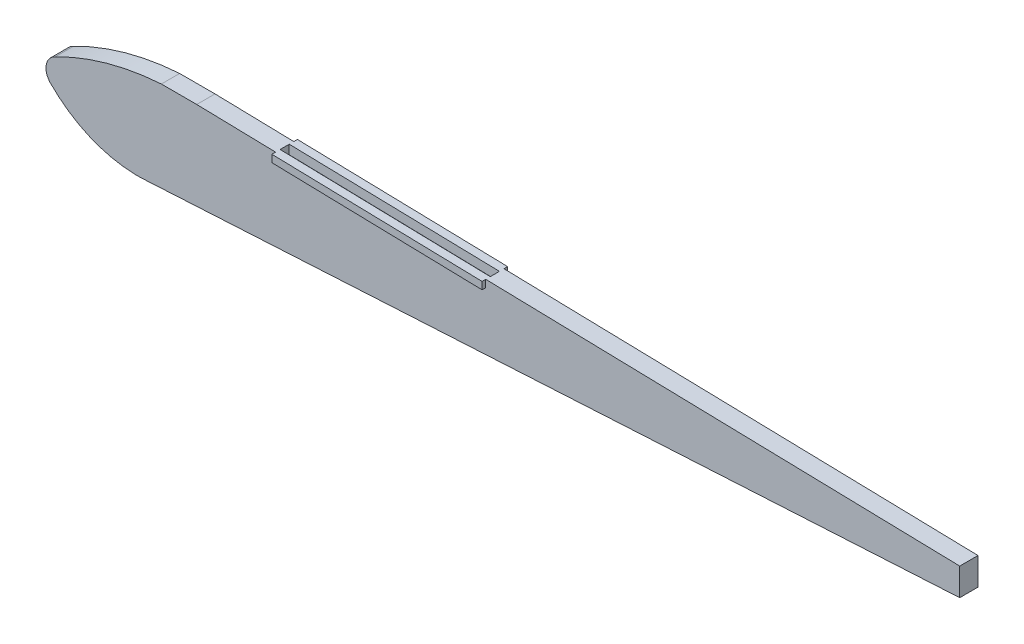
ISO-10303-21;
HEADER;
FILE_DESCRIPTION(('STEP AP214'),'2;1');
FILE_NAME('part.step','',(''),(''),'','','');
FILE_SCHEMA(('AUTOMOTIVE_DESIGN { 1 0 10303 214 1 1 1 1 }'));
ENDSEC;
DATA;
#1=APPLICATION_CONTEXT('core data for automotive mechanical design processes');
#2=APPLICATION_PROTOCOL_DEFINITION('international standard','automotive_design',2000,#1);
#3=PRODUCT_CONTEXT('',#1,'mechanical');
#4=PRODUCT('Part','Part','',(#3));
#5=PRODUCT_RELATED_PRODUCT_CATEGORY('part','',(#4));
#6=PRODUCT_DEFINITION_FORMATION('','',#4);
#7=PRODUCT_DEFINITION_CONTEXT('part definition',#1,'design');
#8=PRODUCT_DEFINITION('design','',#6,#7);
#9=PRODUCT_DEFINITION_SHAPE('','',#8);
#10=(LENGTH_UNIT() NAMED_UNIT(*) SI_UNIT(.MILLI.,.METRE.));
#11=(NAMED_UNIT(*) PLANE_ANGLE_UNIT() SI_UNIT($,.RADIAN.));
#12=(NAMED_UNIT(*) SI_UNIT($,.STERADIAN.) SOLID_ANGLE_UNIT());
#13=UNCERTAINTY_MEASURE_WITH_UNIT(LENGTH_MEASURE(1.E-05),#10,'distance_accuracy_value','');
#14=(GEOMETRIC_REPRESENTATION_CONTEXT(3) GLOBAL_UNCERTAINTY_ASSIGNED_CONTEXT((#13)) GLOBAL_UNIT_ASSIGNED_CONTEXT((#10,
#11,#12)) REPRESENTATION_CONTEXT('',''));
#15=CARTESIAN_POINT('',(0.,0.,0.));
#16=DIRECTION('',(0.,0.,1.));
#17=DIRECTION('',(1.,0.,0.));
#18=AXIS2_PLACEMENT_3D('',#15,#16,#17);
#19=CARTESIAN_POINT('',(533.352405612948,25.,10.));
#20=DIRECTION('',(-1.,0.,0.));
#21=DIRECTION('',(0.,0.,1.));
#22=AXIS2_PLACEMENT_3D('',#19,#20,#21);
#23=PLANE('',#22);
#24=DIRECTION('',(0.,0.,1.));
#25=VECTOR('',#24,1.);
#26=CARTESIAN_POINT('',(533.352405612948,15.,0.));
#27=LINE('',#26,#25);
#28=CARTESIAN_POINT('',(533.352405612948,15.,0.));
#29=VERTEX_POINT('',#28);
#30=CARTESIAN_POINT('',(533.352405612948,15.,10.));
#31=VERTEX_POINT('',#30);
#32=EDGE_CURVE('E307',#29,#31,#27,.T.);
#33=ORIENTED_EDGE('',*,*,#32,.T.);
#34=DIRECTION('',(0.,1.,0.));
#35=VECTOR('',#34,1.);
#36=CARTESIAN_POINT('',(533.352405612948,25.,10.));
#37=LINE('',#36,#35);
#38=CARTESIAN_POINT('',(533.352405612948,0.,10.));
#39=VERTEX_POINT('',#38);
#40=EDGE_CURVE('E340',#39,#31,#37,.T.);
#41=ORIENTED_EDGE('',*,*,#40,.F.);
#42=DIRECTION('',(0.,0.,1.));
#43=VECTOR('',#42,1.);
#44=CARTESIAN_POINT('',(533.352405612948,0.,0.));
#45=LINE('',#44,#43);
#46=CARTESIAN_POINT('',(533.352405612948,0.,0.));
#47=VERTEX_POINT('',#46);
#48=EDGE_CURVE('E299',#47,#39,#45,.T.);
#49=ORIENTED_EDGE('',*,*,#48,.F.);
#50=DIRECTION('',(0.,1.,0.));
#51=VECTOR('',#50,1.);
#52=CARTESIAN_POINT('',(533.352405612948,25.,0.));
#53=LINE('',#52,#51);
#54=EDGE_CURVE('E333',#47,#29,#53,.T.);
#55=ORIENTED_EDGE('',*,*,#54,.T.);
#56=EDGE_LOOP('',(#33,#41,#49,#55));
#57=FACE_BOUND('',#56,.T.);
#58=ADVANCED_FACE('F64',(#57),#23,.F.);
#59=CARTESIAN_POINT('',(33.3524056129477,25.,10.));
#60=DIRECTION('',(0.,-1.,0.));
#61=DIRECTION('',(0.,0.,-1.));
#62=AXIS2_PLACEMENT_3D('',#59,#60,#61);
#63=PLANE('',#62);
#64=DIRECTION('',(0.,0.,1.));
#65=VECTOR('',#64,1.);
#66=CARTESIAN_POINT('',(115.905115223947,25.,0.));
#67=LINE('',#66,#65);
#68=CARTESIAN_POINT('',(115.905115223947,25.,0.));
#69=VERTEX_POINT('',#68);
#70=CARTESIAN_POINT('',(115.905115223947,25.,10.));
#71=VERTEX_POINT('',#70);
#72=EDGE_CURVE('E298',#69,#71,#67,.T.);
#73=ORIENTED_EDGE('',*,*,#72,.F.);
#74=DIRECTION('',(-1.,0.,0.));
#75=VECTOR('',#74,1.);
#76=CARTESIAN_POINT('',(33.3524056129477,25.,0.));
#77=LINE('',#76,#75);
#78=CARTESIAN_POINT('',(96.5365990158575,25.,0.));
#79=VERTEX_POINT('',#78);
#80=EDGE_CURVE('E351',#69,#79,#77,.T.);
#81=ORIENTED_EDGE('',*,*,#80,.T.);
#82=DIRECTION('',(0.,0.,1.));
#83=VECTOR('',#82,1.);
#84=CARTESIAN_POINT('',(96.5365990158575,25.,0.));
#85=LINE('',#84,#83);
#86=CARTESIAN_POINT('',(96.5365990158575,25.,10.));
#87=VERTEX_POINT('',#86);
#88=EDGE_CURVE('E336',#79,#87,#85,.T.);
#89=ORIENTED_EDGE('',*,*,#88,.T.);
#90=DIRECTION('',(-1.,0.,0.));
#91=VECTOR('',#90,1.);
#92=CARTESIAN_POINT('',(33.3524056129477,25.,10.));
#93=LINE('',#92,#91);
#94=EDGE_CURVE('E343',#71,#87,#93,.T.);
#95=ORIENTED_EDGE('',*,*,#94,.F.);
#96=EDGE_LOOP('',(#73,#81,#89,#95));
#97=FACE_BOUND('',#96,.T.);
#98=ADVANCED_FACE('F385',(#97),#63,.F.);
#99=CARTESIAN_POINT('',(33.3524056129477,-25.,10.));
#100=DIRECTION('',(0.,1.,0.));
#101=DIRECTION('',(-1.,0.,0.));
#102=AXIS2_PLACEMENT_3D('',#99,#100,#101);
#103=PLANE('',#102);
#104=DIRECTION('',(0.,0.,1.));
#105=VECTOR('',#104,1.);
#106=CARTESIAN_POINT('',(85.6277654450882,-25.,0.));
#107=LINE('',#106,#105);
#108=CARTESIAN_POINT('',(85.6277654450882,-25.,0.));
#109=VERTEX_POINT('',#108);
#110=CARTESIAN_POINT('',(85.6277654450882,-25.,10.));
#111=VERTEX_POINT('',#110);
#112=EDGE_CURVE('E294',#109,#111,#107,.T.);
#113=ORIENTED_EDGE('',*,*,#112,.T.);
#114=DIRECTION('',(1.,0.,0.));
#115=VECTOR('',#114,1.);
#116=CARTESIAN_POINT('',(33.3524056129477,-25.,10.));
#117=LINE('',#116,#115);
#118=CARTESIAN_POINT('',(81.9930406640099,-25.,10.));
#119=VERTEX_POINT('',#118);
#120=EDGE_CURVE('E71',#119,#111,#117,.T.);
#121=ORIENTED_EDGE('',*,*,#120,.F.);
#122=DIRECTION('',(0.,0.,1.));
#123=VECTOR('',#122,1.);
#124=CARTESIAN_POINT('',(81.9930406640099,-25.,0.));
#125=LINE('',#124,#123);
#126=CARTESIAN_POINT('',(81.9930406640099,-25.,0.));
#127=VERTEX_POINT('',#126);
#128=EDGE_CURVE('E334',#127,#119,#125,.T.);
#129=ORIENTED_EDGE('',*,*,#128,.F.);
#130=DIRECTION('',(1.,0.,0.));
#131=VECTOR('',#130,1.);
#132=CARTESIAN_POINT('',(33.3524056129477,-25.,0.));
#133=LINE('',#132,#131);
#134=EDGE_CURVE('E344',#127,#109,#133,.T.);
#135=ORIENTED_EDGE('',*,*,#134,.T.);
#136=EDGE_LOOP('',(#113,#121,#129,#135));
#137=FACE_BOUND('',#136,.T.);
#138=ADVANCED_FACE('F357',(#137),#103,.F.);
#139=CARTESIAN_POINT('',(0.,0.,10.));
#140=DIRECTION('',(0.,0.,1.));
#141=DIRECTION('',(1.,0.,0.));
#142=AXIS2_PLACEMENT_3D('',#139,#140,#141);
#143=PLANE('',#142);
#144=DIRECTION('',(0.,-1.,0.));
#145=VECTOR('',#144,1.);
#146=CARTESIAN_POINT('',(159.003178699736,0.,10.));
#147=LINE('',#146,#145);
#148=CARTESIAN_POINT('',(159.003178699736,23.9675807109533,10.));
#149=VERTEX_POINT('',#148);
#150=CARTESIAN_POINT('',(159.003178699736,19.9675807109533,10.));
#151=VERTEX_POINT('',#150);
#152=EDGE_CURVE('E288',#149,#151,#147,.T.);
#153=ORIENTED_EDGE('',*,*,#152,.F.);
#154=DIRECTION('',(-0.999713199538115,0.0239482498163188,0.));
#155=VECTOR('',#154,1.);
#156=CARTESIAN_POINT('',(0.665008283624476,27.7605906085277,10.));
#157=LINE('',#156,#155);
#158=EDGE_CURVE('E291',#149,#71,#157,.T.);
#159=ORIENTED_EDGE('',*,*,#158,.T.);
#160=ORIENTED_EDGE('',*,*,#94,.T.);
#161=CARTESIAN_POINT('',(106.220857119902,-122.230401184775,10.));
#162=DIRECTION('',(0.,0.,1.));
#163=DIRECTION('',(1.,0.,0.));
#164=AXIS2_PLACEMENT_3D('',#161,#162,#163);
#165=CIRCLE('',#164,147.548554340785);
#166=CARTESIAN_POINT('',(38.404725067647,8.80985263643309,10.));
#167=VERTEX_POINT('',#166);
#168=EDGE_CURVE('E326',#167,#87,#165,.F.);
#169=ORIENTED_EDGE('',*,*,#168,.F.);
#170=CARTESIAN_POINT('',(41.9407111893882,1.05133472372193,10.));
#171=DIRECTION('',(0.,0.,1.));
#172=DIRECTION('',(1.,0.,0.));
#173=AXIS2_PLACEMENT_3D('',#170,#171,#172);
#174=CIRCLE('',#173,8.52630037325727);
#175=CARTESIAN_POINT('',(35.7524239757133,-4.81406376368488,10.));
#176=VERTEX_POINT('',#175);
#177=EDGE_CURVE('E301',#167,#176,#174,.T.);
#178=ORIENTED_EDGE('',*,*,#177,.T.);
#179=CARTESIAN_POINT('',(83.8104030545491,42.2185460473653,10.));
#180=DIRECTION('',(0.,0.,1.));
#181=DIRECTION('',(1.,0.,0.));
#182=AXIS2_PLACEMENT_3D('',#179,#180,#181);
#183=CIRCLE('',#182,67.2431092289784);
#184=EDGE_CURVE('E318',#176,#119,#183,.T.);
#185=ORIENTED_EDGE('',*,*,#184,.T.);
#186=ORIENTED_EDGE('',*,*,#120,.T.);
#187=DIRECTION('',(0.998444700893418,0.0557510471458017,0.));
#188=VECTOR('',#187,1.);
#189=CARTESIAN_POINT('',(1.65775488425238,-29.6887083615363,10.));
#190=LINE('',#189,#188);
#191=EDGE_CURVE('E295',#111,#39,#190,.T.);
#192=ORIENTED_EDGE('',*,*,#191,.T.);
#193=ORIENTED_EDGE('',*,*,#40,.T.);
#194=CARTESIAN_POINT('',(274.003178699737,21.2127418930312,10.));
#195=VERTEX_POINT('',#194);
#196=EDGE_CURVE('E309',#31,#195,#157,.T.);
#197=ORIENTED_EDGE('',*,*,#196,.T.);
#198=DIRECTION('',(0.,1.,0.));
#199=VECTOR('',#198,1.);
#200=CARTESIAN_POINT('',(274.003178699736,0.,10.));
#201=LINE('',#200,#199);
#202=CARTESIAN_POINT('',(274.003178699736,17.2127418930312,10.));
#203=VERTEX_POINT('',#202);
#204=EDGE_CURVE('E282',#203,#195,#201,.T.);
#205=ORIENTED_EDGE('',*,*,#204,.F.);
#206=DIRECTION('',(0.999713199538115,-0.023948249816319,0.));
#207=VECTOR('',#206,1.);
#208=CARTESIAN_POINT('',(0.569242757835642,23.7628846832048,10.));
#209=LINE('',#208,#207);
#210=EDGE_CURVE('E86',#151,#203,#209,.T.);
#211=ORIENTED_EDGE('',*,*,#210,.F.);
#212=EDGE_LOOP('',(#153,#159,#160,#169,#178,#185,#186,#192,#193,#197,#205,#211));
#213=FACE_BOUND('',#212,.T.);
#214=ADVANCED_FACE('F372',(#213),#143,.T.);
#215=CARTESIAN_POINT('',(0.,0.,0.));
#216=DIRECTION('',(0.,0.,1.));
#217=DIRECTION('',(1.,0.,0.));
#218=AXIS2_PLACEMENT_3D('',#215,#216,#217);
#219=PLANE('',#218);
#220=DIRECTION('',(-0.999713199538115,0.0239482498163188,0.));
#221=VECTOR('',#220,1.);
#222=CARTESIAN_POINT('',(0.665008283624476,27.7605906085277,0.));
#223=LINE('',#222,#221);
#224=CARTESIAN_POINT('',(159.003178699736,23.9675807109533,0.));
#225=VERTEX_POINT('',#224);
#226=EDGE_CURVE('E308',#225,#69,#223,.T.);
#227=ORIENTED_EDGE('',*,*,#226,.F.);
#228=DIRECTION('',(0.,-1.,0.));
#229=VECTOR('',#228,1.);
#230=CARTESIAN_POINT('',(159.003178699736,0.,0.));
#231=LINE('',#230,#229);
#232=CARTESIAN_POINT('',(159.003178699736,19.9675807109533,0.));
#233=VERTEX_POINT('',#232);
#234=EDGE_CURVE('E285',#225,#233,#231,.T.);
#235=ORIENTED_EDGE('',*,*,#234,.T.);
#236=DIRECTION('',(0.999713199538115,-0.023948249816319,0.));
#237=VECTOR('',#236,1.);
#238=CARTESIAN_POINT('',(0.569242757835642,23.7628846832048,0.));
#239=LINE('',#238,#237);
#240=CARTESIAN_POINT('',(274.003178699736,17.2127418930312,0.));
#241=VERTEX_POINT('',#240);
#242=EDGE_CURVE('E12',#233,#241,#239,.T.);
#243=ORIENTED_EDGE('',*,*,#242,.T.);
#244=DIRECTION('',(0.,1.,0.));
#245=VECTOR('',#244,1.);
#246=CARTESIAN_POINT('',(274.003178699736,0.,0.));
#247=LINE('',#246,#245);
#248=CARTESIAN_POINT('',(274.003178699736,21.2127418930312,0.));
#249=VERTEX_POINT('',#248);
#250=EDGE_CURVE('E267',#241,#249,#247,.T.);
#251=ORIENTED_EDGE('',*,*,#250,.T.);
#252=EDGE_CURVE('E304',#29,#249,#223,.T.);
#253=ORIENTED_EDGE('',*,*,#252,.F.);
#254=ORIENTED_EDGE('',*,*,#54,.F.);
#255=DIRECTION('',(0.998444700893418,0.0557510471458017,0.));
#256=VECTOR('',#255,1.);
#257=CARTESIAN_POINT('',(1.65775488425238,-29.6887083615363,0.));
#258=LINE('',#257,#256);
#259=EDGE_CURVE('E292',#109,#47,#258,.T.);
#260=ORIENTED_EDGE('',*,*,#259,.F.);
#261=ORIENTED_EDGE('',*,*,#134,.F.);
#262=CARTESIAN_POINT('',(83.8104030545491,42.2185460473653,0.));
#263=DIRECTION('',(0.,0.,1.));
#264=DIRECTION('',(1.,0.,0.));
#265=AXIS2_PLACEMENT_3D('',#262,#263,#264);
#266=CIRCLE('',#265,67.2431092289784);
#267=CARTESIAN_POINT('',(35.7524239757133,-4.81406376368488,0.));
#268=VERTEX_POINT('',#267);
#269=EDGE_CURVE('E321',#268,#127,#266,.T.);
#270=ORIENTED_EDGE('',*,*,#269,.F.);
#271=CARTESIAN_POINT('',(41.9407111893882,1.05133472372193,0.));
#272=DIRECTION('',(0.,0.,1.));
#273=DIRECTION('',(1.,0.,0.));
#274=AXIS2_PLACEMENT_3D('',#271,#272,#273);
#275=CIRCLE('',#274,8.52630037325727);
#276=CARTESIAN_POINT('',(38.404725067647,8.80985263643309,0.));
#277=VERTEX_POINT('',#276);
#278=EDGE_CURVE('E315',#277,#268,#275,.T.);
#279=ORIENTED_EDGE('',*,*,#278,.F.);
#280=CARTESIAN_POINT('',(106.220857119902,-122.230401184775,0.));
#281=DIRECTION('',(0.,0.,1.));
#282=DIRECTION('',(1.,0.,0.));
#283=AXIS2_PLACEMENT_3D('',#280,#281,#282);
#284=CIRCLE('',#283,147.548554340785);
#285=EDGE_CURVE('E317',#277,#79,#284,.F.);
#286=ORIENTED_EDGE('',*,*,#285,.T.);
#287=ORIENTED_EDGE('',*,*,#80,.F.);
#288=EDGE_LOOP('',(#227,#235,#243,#251,#253,#254,#260,#261,#270,#279,#286,#287));
#289=FACE_BOUND('',#288,.T.);
#290=ADVANCED_FACE('F363',(#289),#219,.F.);
#291=CARTESIAN_POINT('',(41.9407111893882,1.05133472372193,0.));
#292=DIRECTION('',(0.,0.,1.));
#293=DIRECTION('',(1.,0.,0.));
#294=AXIS2_PLACEMENT_3D('',#291,#292,#293);
#295=CYLINDRICAL_SURFACE('',#294,8.52630037325727);
#296=ORIENTED_EDGE('',*,*,#177,.F.);
#297=DIRECTION('',(0.,0.,1.));
#298=VECTOR('',#297,1.);
#299=CARTESIAN_POINT('',(38.404725067647,8.80985263643309,0.));
#300=LINE('',#299,#298);
#301=EDGE_CURVE('E323',#277,#167,#300,.T.);
#302=ORIENTED_EDGE('',*,*,#301,.F.);
#303=ORIENTED_EDGE('',*,*,#278,.T.);
#304=DIRECTION('',(0.,0.,1.));
#305=VECTOR('',#304,1.);
#306=CARTESIAN_POINT('',(35.7524239757133,-4.81406376368488,0.));
#307=LINE('',#306,#305);
#308=EDGE_CURVE('E330',#268,#176,#307,.T.);
#309=ORIENTED_EDGE('',*,*,#308,.T.);
#310=EDGE_LOOP('',(#296,#302,#303,#309));
#311=FACE_BOUND('',#310,.T.);
#312=ADVANCED_FACE('F379',(#311),#295,.T.);
#313=CARTESIAN_POINT('',(83.8104030545491,42.2185460473653,0.));
#314=DIRECTION('',(0.,0.,1.));
#315=DIRECTION('',(1.,0.,0.));
#316=AXIS2_PLACEMENT_3D('',#313,#314,#315);
#317=CYLINDRICAL_SURFACE('',#316,67.2431092289784);
#318=ORIENTED_EDGE('',*,*,#184,.F.);
#319=ORIENTED_EDGE('',*,*,#308,.F.);
#320=ORIENTED_EDGE('',*,*,#269,.T.);
#321=ORIENTED_EDGE('',*,*,#128,.T.);
#322=EDGE_LOOP('',(#318,#319,#320,#321));
#323=FACE_BOUND('',#322,.T.);
#324=ADVANCED_FACE('F377',(#323),#317,.T.);
#325=CARTESIAN_POINT('',(106.220857119902,-122.230401184775,0.));
#326=DIRECTION('',(0.,0.,1.));
#327=DIRECTION('',(1.,0.,0.));
#328=AXIS2_PLACEMENT_3D('',#325,#326,#327);
#329=CYLINDRICAL_SURFACE('',#328,147.548554340785);
#330=ORIENTED_EDGE('',*,*,#168,.T.);
#331=ORIENTED_EDGE('',*,*,#88,.F.);
#332=ORIENTED_EDGE('',*,*,#285,.F.);
#333=ORIENTED_EDGE('',*,*,#301,.T.);
#334=EDGE_LOOP('',(#330,#331,#332,#333));
#335=FACE_BOUND('',#334,.T.);
#336=ADVANCED_FACE('F416',(#335),#329,.T.);
#337=CARTESIAN_POINT('',(1.65775488425238,-29.6887083615363,0.));
#338=DIRECTION('',(0.0557510471458017,-0.998444700893418,0.));
#339=DIRECTION('',(0.998444700893418,0.0557510471458017,0.));
#340=AXIS2_PLACEMENT_3D('',#337,#338,#339);
#341=PLANE('',#340);
#342=ORIENTED_EDGE('',*,*,#191,.F.);
#343=ORIENTED_EDGE('',*,*,#112,.F.);
#344=ORIENTED_EDGE('',*,*,#259,.T.);
#345=ORIENTED_EDGE('',*,*,#48,.T.);
#346=EDGE_LOOP('',(#342,#343,#344,#345));
#347=FACE_BOUND('',#346,.T.);
#348=ADVANCED_FACE('F369',(#347),#341,.T.);
#349=CARTESIAN_POINT('',(0.665008283624476,27.7605906085277,0.));
#350=DIRECTION('',(0.0239482498163188,0.999713199538115,0.));
#351=DIRECTION('',(-0.999713199538115,0.0239482498163188,0.));
#352=AXIS2_PLACEMENT_3D('',#349,#350,#351);
#353=PLANE('',#352);
#354=DIRECTION('',(0.,0.,-1.));
#355=VECTOR('',#354,1.);
#356=CARTESIAN_POINT('',(274.003178699737,21.2127418930312,2.5));
#357=LINE('',#356,#355);
#358=CARTESIAN_POINT('',(274.003178699737,21.2127418930312,7.5));
#359=VERTEX_POINT('',#358);
#360=CARTESIAN_POINT('',(274.003178699737,21.2127418930312,2.5));
#361=VERTEX_POINT('',#360);
#362=EDGE_CURVE('E78',#359,#361,#357,.T.);
#363=ORIENTED_EDGE('',*,*,#362,.F.);
#364=DIRECTION('',(0.999713199538115,-0.0239482498163188,0.));
#365=VECTOR('',#364,1.);
#366=CARTESIAN_POINT('',(159.003178699736,23.9675807109533,7.5));
#367=LINE('',#366,#365);
#368=CARTESIAN_POINT('',(159.003178699736,23.9675807109533,7.5));
#369=VERTEX_POINT('',#368);
#370=EDGE_CURVE('E221',#369,#359,#367,.T.);
#371=ORIENTED_EDGE('',*,*,#370,.F.);
#372=DIRECTION('',(0.,0.,1.));
#373=VECTOR('',#372,1.);
#374=CARTESIAN_POINT('',(159.003178699736,23.9675807109533,2.5));
#375=LINE('',#374,#373);
#376=CARTESIAN_POINT('',(159.003178699736,23.9675807109533,2.5));
#377=VERTEX_POINT('',#376);
#378=EDGE_CURVE('E224',#377,#369,#375,.T.);
#379=ORIENTED_EDGE('',*,*,#378,.F.);
#380=DIRECTION('',(-0.999713199538115,0.0239482498163188,0.));
#381=VECTOR('',#380,1.);
#382=CARTESIAN_POINT('',(159.003178699736,23.9675807109533,2.5));
#383=LINE('',#382,#381);
#384=EDGE_CURVE('E230',#361,#377,#383,.T.);
#385=ORIENTED_EDGE('',*,*,#384,.F.);
#386=EDGE_LOOP('',(#363,#371,#379,#385));
#387=FACE_BOUND('',#386,.T.);
#388=ORIENTED_EDGE('',*,*,#252,.T.);
#389=DIRECTION('',(0.,0.,-1.));
#390=VECTOR('',#389,1.);
#391=CARTESIAN_POINT('',(274.003178699736,21.2127418930312,12.));
#392=LINE('',#391,#390);
#393=CARTESIAN_POINT('',(274.003178699736,21.2127418930312,-2.));
#394=VERTEX_POINT('',#393);
#395=EDGE_CURVE('E276',#249,#394,#392,.T.);
#396=ORIENTED_EDGE('',*,*,#395,.T.);
#397=DIRECTION('',(0.999713199538115,-0.0239482498163188,0.));
#398=VECTOR('',#397,1.);
#399=CARTESIAN_POINT('',(159.003178699736,23.9675807109533,-2.));
#400=LINE('',#399,#398);
#401=CARTESIAN_POINT('',(159.003178699736,23.9675807109533,-2.));
#402=VERTEX_POINT('',#401);
#403=EDGE_CURVE('E242',#402,#394,#400,.T.);
#404=ORIENTED_EDGE('',*,*,#403,.F.);
#405=DIRECTION('',(0.,0.,-1.));
#406=VECTOR('',#405,1.);
#407=CARTESIAN_POINT('',(159.003178699736,23.9675807109533,12.));
#408=LINE('',#407,#406);
#409=EDGE_CURVE('E263',#225,#402,#408,.T.);
#410=ORIENTED_EDGE('',*,*,#409,.F.);
#411=ORIENTED_EDGE('',*,*,#226,.T.);
#412=ORIENTED_EDGE('',*,*,#72,.T.);
#413=ORIENTED_EDGE('',*,*,#158,.F.);
#414=CARTESIAN_POINT('',(159.003178699736,23.9675807109533,12.));
#415=VERTEX_POINT('',#414);
#416=EDGE_CURVE('E277',#415,#149,#408,.T.);
#417=ORIENTED_EDGE('',*,*,#416,.F.);
#418=DIRECTION('',(0.999713199538115,-0.0239482498163188,0.));
#419=VECTOR('',#418,1.);
#420=CARTESIAN_POINT('',(159.003178699736,23.9675807109533,12.));
#421=LINE('',#420,#419);
#422=CARTESIAN_POINT('',(274.003178699736,21.2127418930312,12.));
#423=VERTEX_POINT('',#422);
#424=EDGE_CURVE('E254',#415,#423,#421,.T.);
#425=ORIENTED_EDGE('',*,*,#424,.T.);
#426=EDGE_CURVE('E273',#423,#195,#392,.T.);
#427=ORIENTED_EDGE('',*,*,#426,.T.);
#428=ORIENTED_EDGE('',*,*,#196,.F.);
#429=ORIENTED_EDGE('',*,*,#32,.F.);
#430=EDGE_LOOP('',(#388,#396,#404,#410,#411,#412,#413,#417,#425,#427,#428,#429));
#431=FACE_BOUND('',#430,.T.);
#432=ADVANCED_FACE('F388',(#387,#431),#353,.T.);
#433=CARTESIAN_POINT('',(0.,0.,-2.));
#434=DIRECTION('',(0.,0.,-1.));
#435=DIRECTION('',(-1.,0.,0.));
#436=AXIS2_PLACEMENT_3D('',#433,#434,#435);
#437=PLANE('',#436);
#438=DIRECTION('',(0.,1.,0.));
#439=VECTOR('',#438,1.);
#440=CARTESIAN_POINT('',(159.003178699736,19.9675807109533,-2.));
#441=LINE('',#440,#439);
#442=CARTESIAN_POINT('',(159.003178699736,19.9675807109533,-2.));
#443=VERTEX_POINT('',#442);
#444=EDGE_CURVE('E236',#443,#402,#441,.T.);
#445=ORIENTED_EDGE('',*,*,#444,.T.);
#446=ORIENTED_EDGE('',*,*,#403,.T.);
#447=DIRECTION('',(0.,-1.,0.));
#448=VECTOR('',#447,1.);
#449=CARTESIAN_POINT('',(274.003178699736,21.2127418930312,-2.));
#450=LINE('',#449,#448);
#451=CARTESIAN_POINT('',(274.003178699736,17.2127418930312,-2.));
#452=VERTEX_POINT('',#451);
#453=EDGE_CURVE('E245',#394,#452,#450,.T.);
#454=ORIENTED_EDGE('',*,*,#453,.T.);
#455=DIRECTION('',(-0.999713199538115,0.023948249816319,0.));
#456=VECTOR('',#455,1.);
#457=CARTESIAN_POINT('',(274.003178699736,17.2127418930312,-2.));
#458=LINE('',#457,#456);
#459=EDGE_CURVE('E248',#452,#443,#458,.T.);
#460=ORIENTED_EDGE('',*,*,#459,.T.);
#461=EDGE_LOOP('',(#445,#446,#454,#460));
#462=FACE_BOUND('',#461,.T.);
#463=ADVANCED_FACE('F400',(#462),#437,.T.);
#464=CARTESIAN_POINT('',(274.003178699736,21.2127418930312,12.));
#465=DIRECTION('',(1.,0.,0.));
#466=DIRECTION('',(0.,0.,-1.));
#467=AXIS2_PLACEMENT_3D('',#464,#465,#466);
#468=PLANE('',#467);
#469=ORIENTED_EDGE('',*,*,#250,.F.);
#470=DIRECTION('',(0.,0.,-1.));
#471=VECTOR('',#470,1.);
#472=CARTESIAN_POINT('',(274.003178699736,17.2127418930312,12.));
#473=LINE('',#472,#471);
#474=EDGE_CURVE('E272',#241,#452,#473,.T.);
#475=ORIENTED_EDGE('',*,*,#474,.T.);
#476=ORIENTED_EDGE('',*,*,#453,.F.);
#477=ORIENTED_EDGE('',*,*,#395,.F.);
#478=EDGE_LOOP('',(#469,#475,#476,#477));
#479=FACE_BOUND('',#478,.T.);
#480=ADVANCED_FACE('F403',(#479),#468,.T.);
#481=CARTESIAN_POINT('',(274.003178699736,17.2127418930312,12.));
#482=DIRECTION('',(-0.023948249816319,-0.999713199538115,0.));
#483=DIRECTION('',(0.999713199538115,-0.023948249816319,0.));
#484=AXIS2_PLACEMENT_3D('',#481,#482,#483);
#485=PLANE('',#484);
#486=ORIENTED_EDGE('',*,*,#242,.F.);
#487=DIRECTION('',(0.,0.,-1.));
#488=VECTOR('',#487,1.);
#489=CARTESIAN_POINT('',(159.003178699736,19.9675807109533,12.));
#490=LINE('',#489,#488);
#491=EDGE_CURVE('E268',#233,#443,#490,.T.);
#492=ORIENTED_EDGE('',*,*,#491,.T.);
#493=ORIENTED_EDGE('',*,*,#459,.F.);
#494=ORIENTED_EDGE('',*,*,#474,.F.);
#495=EDGE_LOOP('',(#486,#492,#493,#494));
#496=FACE_BOUND('',#495,.T.);
#497=ADVANCED_FACE('F397',(#496),#485,.T.);
#498=CARTESIAN_POINT('',(159.003178699736,19.9675807109533,12.));
#499=DIRECTION('',(-1.,0.,0.));
#500=DIRECTION('',(0.,0.,1.));
#501=AXIS2_PLACEMENT_3D('',#498,#499,#500);
#502=PLANE('',#501);
#503=ORIENTED_EDGE('',*,*,#234,.F.);
#504=ORIENTED_EDGE('',*,*,#409,.T.);
#505=ORIENTED_EDGE('',*,*,#444,.F.);
#506=ORIENTED_EDGE('',*,*,#491,.F.);
#507=EDGE_LOOP('',(#503,#504,#505,#506));
#508=FACE_BOUND('',#507,.T.);
#509=ADVANCED_FACE('F393',(#508),#502,.T.);
#510=ORIENTED_EDGE('',*,*,#416,.T.);
#511=ORIENTED_EDGE('',*,*,#152,.T.);
#512=CARTESIAN_POINT('',(159.003178699736,19.9675807109533,12.));
#513=VERTEX_POINT('',#512);
#514=EDGE_CURVE('E264',#513,#151,#490,.T.);
#515=ORIENTED_EDGE('',*,*,#514,.F.);
#516=DIRECTION('',(0.,1.,0.));
#517=VECTOR('',#516,1.);
#518=CARTESIAN_POINT('',(159.003178699736,19.9675807109533,12.));
#519=LINE('',#518,#517);
#520=EDGE_CURVE('E251',#513,#415,#519,.T.);
#521=ORIENTED_EDGE('',*,*,#520,.T.);
#522=EDGE_LOOP('',(#510,#511,#515,#521));
#523=FACE_BOUND('',#522,.T.);
#524=ADVANCED_FACE('F415',(#523),#502,.T.);
#525=ORIENTED_EDGE('',*,*,#514,.T.);
#526=ORIENTED_EDGE('',*,*,#210,.T.);
#527=CARTESIAN_POINT('',(274.003178699736,17.2127418930312,12.));
#528=VERTEX_POINT('',#527);
#529=EDGE_CURVE('E269',#528,#203,#473,.T.);
#530=ORIENTED_EDGE('',*,*,#529,.F.);
#531=DIRECTION('',(-0.999713199538115,0.023948249816319,0.));
#532=VECTOR('',#531,1.);
#533=CARTESIAN_POINT('',(274.003178699736,17.2127418930312,12.));
#534=LINE('',#533,#532);
#535=EDGE_CURVE('E260',#528,#513,#534,.T.);
#536=ORIENTED_EDGE('',*,*,#535,.T.);
#537=EDGE_LOOP('',(#525,#526,#530,#536));
#538=FACE_BOUND('',#537,.T.);
#539=ADVANCED_FACE('F413',(#538),#485,.T.);
#540=ORIENTED_EDGE('',*,*,#529,.T.);
#541=ORIENTED_EDGE('',*,*,#204,.T.);
#542=ORIENTED_EDGE('',*,*,#426,.F.);
#543=DIRECTION('',(0.,-1.,0.));
#544=VECTOR('',#543,1.);
#545=CARTESIAN_POINT('',(274.003178699736,21.2127418930312,12.));
#546=LINE('',#545,#544);
#547=EDGE_CURVE('E257',#423,#528,#546,.T.);
#548=ORIENTED_EDGE('',*,*,#547,.T.);
#549=EDGE_LOOP('',(#540,#541,#542,#548));
#550=FACE_BOUND('',#549,.T.);
#551=ADVANCED_FACE('F407',(#550),#468,.T.);
#552=CARTESIAN_POINT('',(0.,0.,12.));
#553=DIRECTION('',(0.,0.,-1.));
#554=DIRECTION('',(-1.,0.,0.));
#555=AXIS2_PLACEMENT_3D('',#552,#553,#554);
#556=PLANE('',#555);
#557=ORIENTED_EDGE('',*,*,#520,.F.);
#558=ORIENTED_EDGE('',*,*,#535,.F.);
#559=ORIENTED_EDGE('',*,*,#547,.F.);
#560=ORIENTED_EDGE('',*,*,#424,.F.);
#561=EDGE_LOOP('',(#557,#558,#559,#560));
#562=FACE_BOUND('',#561,.T.);
#563=ADVANCED_FACE('F411',(#562),#556,.F.);
#564=CARTESIAN_POINT('',(273.883437450655,16.2141758953407,2.5));
#565=DIRECTION('',(0.999713199538115,-0.0239482498163188,0.));
#566=DIRECTION('',(0.0239482498163188,0.999713199538115,0.));
#567=AXIS2_PLACEMENT_3D('',#564,#565,#566);
#568=PLANE('',#567);
#569=ORIENTED_EDGE('',*,*,#362,.T.);
#570=DIRECTION('',(0.0239482498163188,0.999713199538115,0.));
#571=VECTOR('',#570,1.);
#572=CARTESIAN_POINT('',(273.883437450655,16.2141758953407,2.5));
#573=LINE('',#572,#571);
#574=CARTESIAN_POINT('',(273.883437450655,16.2141758953407,2.5));
#575=VERTEX_POINT('',#574);
#576=EDGE_CURVE('E199',#575,#361,#573,.T.);
#577=ORIENTED_EDGE('',*,*,#576,.F.);
#578=DIRECTION('',(0.,0.,-1.));
#579=VECTOR('',#578,1.);
#580=CARTESIAN_POINT('',(273.883437450655,16.2141758953407,2.5));
#581=LINE('',#580,#579);
#582=CARTESIAN_POINT('',(273.883437450655,16.2141758953407,7.5));
#583=VERTEX_POINT('',#582);
#584=EDGE_CURVE('E203',#583,#575,#581,.T.);
#585=ORIENTED_EDGE('',*,*,#584,.F.);
#586=DIRECTION('',(0.0239482498163188,0.999713199538115,0.));
#587=VECTOR('',#586,1.);
#588=CARTESIAN_POINT('',(273.883437450655,16.2141758953407,7.5));
#589=LINE('',#588,#587);
#590=EDGE_CURVE('E234',#583,#359,#589,.T.);
#591=ORIENTED_EDGE('',*,*,#590,.T.);
#592=EDGE_LOOP('',(#569,#577,#585,#591));
#593=FACE_BOUND('',#592,.T.);
#594=ADVANCED_FACE('F201',(#593),#568,.F.);
#595=CARTESIAN_POINT('',(158.883437450655,18.9690147132627,7.5));
#596=DIRECTION('',(0.,0.,1.));
#597=DIRECTION('',(1.,0.,0.));
#598=AXIS2_PLACEMENT_3D('',#595,#596,#597);
#599=PLANE('',#598);
#600=ORIENTED_EDGE('',*,*,#370,.T.);
#601=ORIENTED_EDGE('',*,*,#590,.F.);
#602=DIRECTION('',(0.999713199538115,-0.0239482498163188,0.));
#603=VECTOR('',#602,1.);
#604=CARTESIAN_POINT('',(158.883437450655,18.9690147132627,7.5));
#605=LINE('',#604,#603);
#606=CARTESIAN_POINT('',(158.883437450655,18.9690147132627,7.5));
#607=VERTEX_POINT('',#606);
#608=EDGE_CURVE('E209',#607,#583,#605,.T.);
#609=ORIENTED_EDGE('',*,*,#608,.F.);
#610=DIRECTION('',(0.0239482498163188,0.999713199538115,0.));
#611=VECTOR('',#610,1.);
#612=CARTESIAN_POINT('',(158.883437450655,18.9690147132627,7.5));
#613=LINE('',#612,#611);
#614=EDGE_CURVE('E237',#607,#369,#613,.T.);
#615=ORIENTED_EDGE('',*,*,#614,.T.);
#616=EDGE_LOOP('',(#600,#601,#609,#615));
#617=FACE_BOUND('',#616,.T.);
#618=ADVANCED_FACE('F562',(#617),#599,.F.);
#619=CARTESIAN_POINT('',(158.883437450655,18.9690147132627,2.5));
#620=DIRECTION('',(-0.999713199538115,0.0239482498163188,0.));
#621=DIRECTION('',(-0.0239482498163188,-0.999713199538115,0.));
#622=AXIS2_PLACEMENT_3D('',#619,#620,#621);
#623=PLANE('',#622);
#624=ORIENTED_EDGE('',*,*,#378,.T.);
#625=ORIENTED_EDGE('',*,*,#614,.F.);
#626=DIRECTION('',(0.,0.,1.));
#627=VECTOR('',#626,1.);
#628=CARTESIAN_POINT('',(158.883437450655,18.9690147132627,2.5));
#629=LINE('',#628,#627);
#630=CARTESIAN_POINT('',(158.883437450655,18.9690147132627,2.5));
#631=VERTEX_POINT('',#630);
#632=EDGE_CURVE('E217',#631,#607,#629,.T.);
#633=ORIENTED_EDGE('',*,*,#632,.F.);
#634=DIRECTION('',(0.0239482498163188,0.999713199538115,0.));
#635=VECTOR('',#634,1.);
#636=CARTESIAN_POINT('',(158.883437450655,18.9690147132627,2.5));
#637=LINE('',#636,#635);
#638=EDGE_CURVE('E208',#631,#377,#637,.T.);
#639=ORIENTED_EDGE('',*,*,#638,.T.);
#640=EDGE_LOOP('',(#624,#625,#633,#639));
#641=FACE_BOUND('',#640,.T.);
#642=ADVANCED_FACE('F572',(#641),#623,.F.);
#643=CARTESIAN_POINT('',(158.883437450655,18.9690147132627,2.5));
#644=DIRECTION('',(0.,0.,-1.));
#645=DIRECTION('',(-1.,0.,0.));
#646=AXIS2_PLACEMENT_3D('',#643,#644,#645);
#647=PLANE('',#646);
#648=ORIENTED_EDGE('',*,*,#384,.T.);
#649=ORIENTED_EDGE('',*,*,#638,.F.);
#650=DIRECTION('',(-0.999713199538115,0.0239482498163188,0.));
#651=VECTOR('',#650,1.);
#652=CARTESIAN_POINT('',(158.883437450655,18.9690147132627,2.5));
#653=LINE('',#652,#651);
#654=EDGE_CURVE('E212',#575,#631,#653,.T.);
#655=ORIENTED_EDGE('',*,*,#654,.F.);
#656=ORIENTED_EDGE('',*,*,#576,.T.);
#657=EDGE_LOOP('',(#648,#649,#655,#656));
#658=FACE_BOUND('',#657,.T.);
#659=ADVANCED_FACE('F213',(#658),#647,.F.);
#660=CARTESIAN_POINT('',(0.545267034542883,22.7620246108372,0.));
#661=DIRECTION('',(0.0239482498163188,0.999713199538115,0.));
#662=DIRECTION('',(-0.999713199538115,0.0239482498163188,0.));
#663=AXIS2_PLACEMENT_3D('',#660,#661,#662);
#664=PLANE('',#663);
#665=ORIENTED_EDGE('',*,*,#584,.T.);
#666=ORIENTED_EDGE('',*,*,#654,.T.);
#667=ORIENTED_EDGE('',*,*,#632,.T.);
#668=ORIENTED_EDGE('',*,*,#608,.T.);
#669=EDGE_LOOP('',(#665,#666,#667,#668));
#670=FACE_BOUND('',#669,.T.);
#671=ADVANCED_FACE('F219',(#670),#664,.T.);
#672=CLOSED_SHELL('',(#58,#98,#138,#214,#290,#312,#324,#336,#348,#432,#463,#480,#497,#509,#524,
#539,#551,#563,#594,#618,#642,#659,#671));
#673=MANIFOLD_SOLID_BREP('B2',#672);
#674=ADVANCED_BREP_SHAPE_REPRESENTATION('',(#18,#673),#14);
#675=SHAPE_DEFINITION_REPRESENTATION(#9,#674);
ENDSEC;
END-ISO-10303-21;
